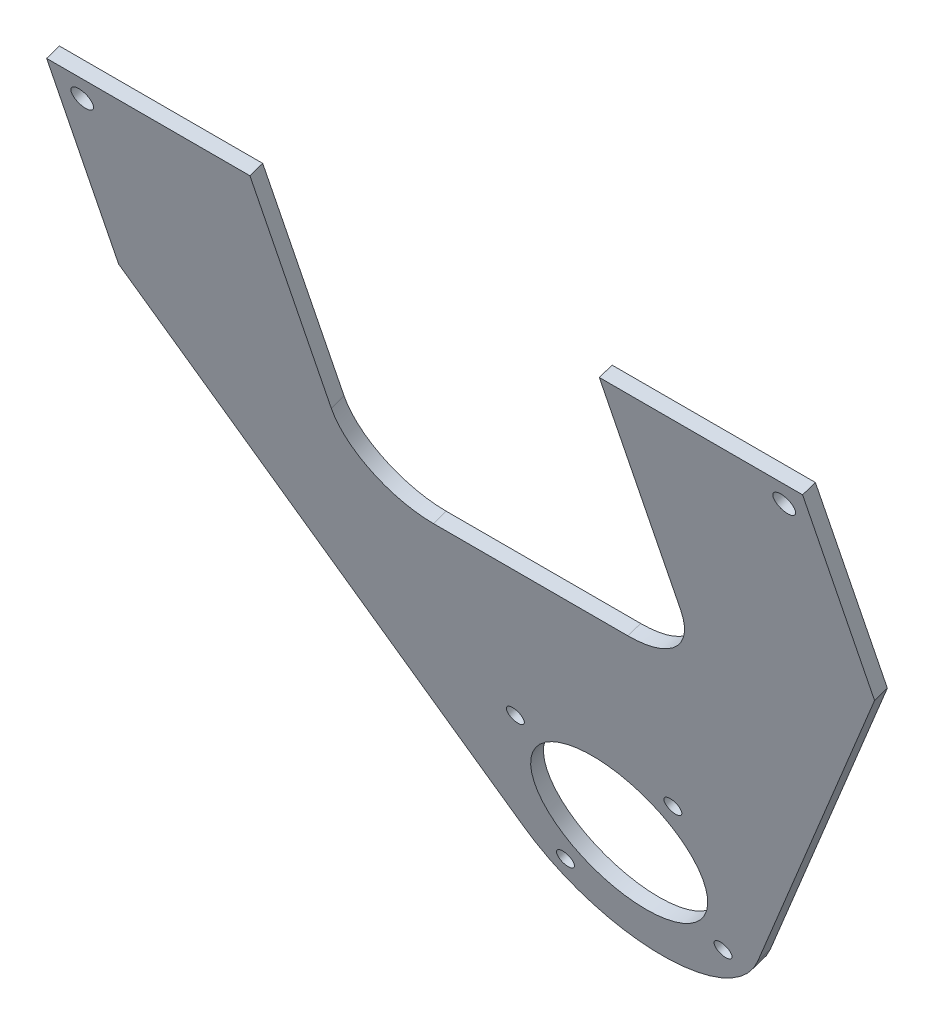
ISO-10303-21;
HEADER;
FILE_DESCRIPTION(('STEP AP214'),'2;1');
FILE_NAME('part.step','',(''),(''),'','','');
FILE_SCHEMA(('AUTOMOTIVE_DESIGN { 1 0 10303 214 1 1 1 1 }'));
ENDSEC;
DATA;
#1=APPLICATION_CONTEXT('core data for automotive mechanical design processes');
#2=APPLICATION_PROTOCOL_DEFINITION('international standard','automotive_design',2000,#1);
#3=PRODUCT_CONTEXT('',#1,'mechanical');
#4=PRODUCT('Part','Part','',(#3));
#5=PRODUCT_RELATED_PRODUCT_CATEGORY('part','',(#4));
#6=PRODUCT_DEFINITION_FORMATION('','',#4);
#7=PRODUCT_DEFINITION_CONTEXT('part definition',#1,'design');
#8=PRODUCT_DEFINITION('design','',#6,#7);
#9=PRODUCT_DEFINITION_SHAPE('','',#8);
#10=(LENGTH_UNIT() NAMED_UNIT(*) SI_UNIT(.MILLI.,.METRE.));
#11=(NAMED_UNIT(*) PLANE_ANGLE_UNIT() SI_UNIT($,.RADIAN.));
#12=(NAMED_UNIT(*) SI_UNIT($,.STERADIAN.) SOLID_ANGLE_UNIT());
#13=UNCERTAINTY_MEASURE_WITH_UNIT(LENGTH_MEASURE(1.E-05),#10,'distance_accuracy_value','');
#14=(GEOMETRIC_REPRESENTATION_CONTEXT(3) GLOBAL_UNCERTAINTY_ASSIGNED_CONTEXT((#13)) GLOBAL_UNIT_ASSIGNED_CONTEXT((#10,
#11,#12)) REPRESENTATION_CONTEXT('',''));
#15=CARTESIAN_POINT('',(0.,0.,0.));
#16=DIRECTION('',(0.,0.,1.));
#17=DIRECTION('',(1.,0.,0.));
#18=AXIS2_PLACEMENT_3D('',#15,#16,#17);
#19=CARTESIAN_POINT('',(88.9,645.377842266813,1331.10155961567));
#20=DIRECTION('',(0.,-0.947879387941359,-0.318629355075634));
#21=DIRECTION('',(0.,0.318629355075634,-0.947879387941359));
#22=AXIS2_PLACEMENT_3D('',#19,#20,#21);
#23=PLANE('',#22);
#24=DIRECTION('',(-1.,0.,0.));
#25=VECTOR('',#24,1.);
#26=CARTESIAN_POINT('',(88.9,645.377842266813,1331.10155961567));
#27=LINE('',#26,#25);
#28=CARTESIAN_POINT('',(-41.0904571991053,645.377842266813,1331.10155961567));
#29=VERTEX_POINT('',#28);
#30=CARTESIAN_POINT('',(-88.9,645.377842266813,1331.10155961567));
#31=VERTEX_POINT('',#30);
#32=EDGE_CURVE('E95',#29,#31,#27,.T.);
#33=ORIENTED_EDGE('',*,*,#32,.F.);
#34=DIRECTION('',(0.,0.318629355075634,-0.947879387941359));
#35=VECTOR('',#34,1.);
#36=CARTESIAN_POINT('',(-41.0904571991053,645.377842266813,1331.10155961567));
#37=LINE('',#36,#35);
#38=CARTESIAN_POINT('',(-41.0904571991053,646.389490469178,1328.09204255895));
#39=VERTEX_POINT('',#38);
#40=EDGE_CURVE('E11',#29,#39,#37,.T.);
#41=ORIENTED_EDGE('',*,*,#40,.T.);
#42=DIRECTION('',(-1.,0.,0.));
#43=VECTOR('',#42,1.);
#44=CARTESIAN_POINT('',(88.9,646.389490469178,1328.09204255895));
#45=LINE('',#44,#43);
#46=CARTESIAN_POINT('',(-88.9,646.389490469178,1328.09204255895));
#47=VERTEX_POINT('',#46);
#48=EDGE_CURVE('E138',#39,#47,#45,.T.);
#49=ORIENTED_EDGE('',*,*,#48,.T.);
#50=DIRECTION('',(0.,0.318629355075634,-0.947879387941359));
#51=VECTOR('',#50,1.);
#52=CARTESIAN_POINT('',(-88.9,645.377842266813,1331.10155961567));
#53=LINE('',#52,#51);
#54=EDGE_CURVE('E152',#31,#47,#53,.T.);
#55=ORIENTED_EDGE('',*,*,#54,.F.);
#56=EDGE_LOOP('',(#33,#41,#49,#55));
#57=FACE_BOUND('',#56,.T.);
#58=ADVANCED_FACE('F36',(#57),#23,.F.);
#59=CARTESIAN_POINT('',(0.,509.247687902836,1285.34145148045));
#60=DIRECTION('',(0.,-0.318629355075634,0.947879387941359));
#61=DIRECTION('',(0.,-0.947879387941359,-0.318629355075634));
#62=AXIS2_PLACEMENT_3D('',#59,#60,#61);
#63=PLANE('',#62);
#64=DIRECTION('',(1.29819621038571E-10,-0.947879387941359,-0.318629355075634));
#65=VECTOR('',#64,1.);
#66=CARTESIAN_POINT('',(-41.0904571804612,509.247687897779,1285.34145147875));
#67=LINE('',#66,#65);
#68=CARTESIAN_POINT('',(-41.0904571913077,588.44378476616,1311.96319427715));
#69=VERTEX_POINT('',#68);
#70=EDGE_CURVE('E218',#29,#69,#67,.T.);
#71=ORIENTED_EDGE('',*,*,#70,.F.);
#72=ORIENTED_EDGE('',*,*,#32,.T.);
#73=DIRECTION('',(0.,-0.947879387941358,-0.318629355075636));
#74=VECTOR('',#73,1.);
#75=CARTESIAN_POINT('',(-88.9,645.377842266813,1331.10155961567));
#76=LINE('',#75,#74);
#77=CARTESIAN_POINT('',(-88.9,595.011167325718,1314.17081783781));
#78=VERTEX_POINT('',#77);
#79=EDGE_CURVE('E185',#31,#78,#76,.T.);
#80=ORIENTED_EDGE('',*,*,#79,.T.);
#81=DIRECTION('',(0.500000000000001,-0.820887629680862,-0.275941115886951));
#82=VECTOR('',#81,1.);
#83=CARTESIAN_POINT('',(-88.9,595.011167325718,1314.17081783781));
#84=LINE('',#83,#82);
#85=CARTESIAN_POINT('',(-27.4963065702007,494.200102619242,1280.28321046862));
#86=VERTEX_POINT('',#85);
#87=EDGE_CURVE('E113',#78,#86,#84,.T.);
#88=ORIENTED_EDGE('',*,*,#87,.T.);
#89=CARTESIAN_POINT('',(0.,509.247687902836,1285.34145148045));
#90=DIRECTION('',(0.,-0.318629355075634,0.947879387941359));
#91=DIRECTION('',(0.,-0.947879387941359,-0.318629355075634));
#92=AXIS2_PLACEMENT_3D('',#89,#90,#91);
#93=CIRCLE('',#92,31.7500000000519);
#94=CARTESIAN_POINT('',(27.4963065702007,494.200102619242,1280.28321046862));
#95=VERTEX_POINT('',#94);
#96=EDGE_CURVE('E105',#86,#95,#93,.T.);
#97=ORIENTED_EDGE('',*,*,#96,.T.);
#98=DIRECTION('',(0.500000000000045,0.820887629680837,0.275941115886943));
#99=VECTOR('',#98,1.);
#100=CARTESIAN_POINT('',(27.4963065702007,494.200102619242,1280.28321046862));
#101=LINE('',#100,#99);
#102=CARTESIAN_POINT('',(88.9,595.011167325706,1314.17081783781));
#103=VERTEX_POINT('',#102);
#104=EDGE_CURVE('E110',#95,#103,#101,.T.);
#105=ORIENTED_EDGE('',*,*,#104,.T.);
#106=DIRECTION('',(0.,0.947879387941359,0.318629355075635));
#107=VECTOR('',#106,1.);
#108=CARTESIAN_POINT('',(88.9,595.011167325706,1314.17081783781));
#109=LINE('',#108,#107);
#110=CARTESIAN_POINT('',(88.9,645.377842266813,1331.10155961567));
#111=VERTEX_POINT('',#110);
#112=EDGE_CURVE('E60',#103,#111,#109,.T.);
#113=ORIENTED_EDGE('',*,*,#112,.T.);
#114=CARTESIAN_POINT('',(41.0904571951463,645.377842266813,1331.10155961567));
#115=VERTEX_POINT('',#114);
#116=EDGE_CURVE('E178',#111,#115,#27,.T.);
#117=ORIENTED_EDGE('',*,*,#116,.T.);
#118=DIRECTION('',(0.,0.947879387941359,0.318629355075634));
#119=VECTOR('',#118,1.);
#120=CARTESIAN_POINT('',(41.0904571951462,509.247687902836,1285.34145148045));
#121=LINE('',#120,#119);
#122=CARTESIAN_POINT('',(41.0904571951463,588.44378476616,1311.96319427715));
#123=VERTEX_POINT('',#122);
#124=EDGE_CURVE('E51',#123,#115,#121,.T.);
#125=ORIENTED_EDGE('',*,*,#124,.F.);
#126=CARTESIAN_POINT('',(22.8600000279249,588.44378476616,1311.96319427715));
#127=DIRECTION('',(0.,-0.318629355075634,0.947879387941359));
#128=DIRECTION('',(0.,-0.947879387941359,-0.318629355075634));
#129=AXIS2_PLACEMENT_3D('',#126,#127,#128);
#130=CIRCLE('',#129,18.2304571672214);
#131=CARTESIAN_POINT('',(22.860000027925,571.163510184603,1306.15443546722));
#132=VERTEX_POINT('',#131);
#133=EDGE_CURVE('E215',#132,#123,#130,.T.);
#134=ORIENTED_EDGE('',*,*,#133,.F.);
#135=DIRECTION('',(1.,0.,0.));
#136=VECTOR('',#135,1.);
#137=CARTESIAN_POINT('',(0.,571.163510184603,1306.15443546722));
#138=LINE('',#137,#136);
#139=CARTESIAN_POINT('',(-22.8600000217195,571.163510184603,1306.15443546722));
#140=VERTEX_POINT('',#139);
#141=EDGE_CURVE('E212',#140,#132,#138,.T.);
#142=ORIENTED_EDGE('',*,*,#141,.F.);
#143=CARTESIAN_POINT('',(-22.8600000217195,588.443784768403,1311.9631942779));
#144=DIRECTION('',(0.,-0.318629355075634,0.947879387941359));
#145=DIRECTION('',(0.,-0.947879387941359,-0.318629355075634));
#146=AXIS2_PLACEMENT_3D('',#143,#144,#145);
#147=CIRCLE('',#146,18.2304571695882);
#148=EDGE_CURVE('E209',#69,#140,#147,.T.);
#149=ORIENTED_EDGE('',*,*,#148,.F.);
#150=EDGE_LOOP('',(#71,#72,#80,#88,#97,#105,#113,#117,#125,#134,#142,#149));
#151=FACE_BOUND('',#150,.T.);
#152=CARTESIAN_POINT('',(18.5217782496758,491.691276071892,1279.43986922188));
#153=DIRECTION('',(0.,-0.318629355075631,0.94787938794136));
#154=DIRECTION('',(0.,-0.94787938794136,-0.318629355075631));
#155=AXIS2_PLACEMENT_3D('',#152,#153,#154);
#156=CIRCLE('',#155,2.01929999999999);
#157=CARTESIAN_POINT('',(18.5217782496758,489.777223223822,1278.79646096518));
#158=VERTEX_POINT('',#157);
#159=EDGE_CURVE('E175',#158,#158,#156,.T.);
#160=ORIENTED_EDGE('',*,*,#159,.F.);
#161=EDGE_LOOP('',(#160));
#162=FACE_BOUND('',#161,.T.);
#163=CARTESIAN_POINT('',(-18.5217782497932,491.691276071892,1279.43986922188));
#164=DIRECTION('',(0.,-0.318629355075631,0.94787938794136));
#165=DIRECTION('',(0.,-0.94787938794136,-0.318629355075631));
#166=AXIS2_PLACEMENT_3D('',#163,#164,#165);
#167=CIRCLE('',#166,2.01929999999999);
#168=CARTESIAN_POINT('',(-18.5217782497932,489.777223223822,1278.79646096518));
#169=VERTEX_POINT('',#168);
#170=EDGE_CURVE('E172',#169,#169,#167,.T.);
#171=ORIENTED_EDGE('',*,*,#170,.F.);
#172=EDGE_LOOP('',(#171));
#173=FACE_BOUND('',#172,.T.);
#174=CARTESIAN_POINT('',(-18.5217782497932,526.80409973378,1291.24303373901));
#175=DIRECTION('',(0.,-0.318629355075631,0.94787938794136));
#176=DIRECTION('',(0.,-0.94787938794136,-0.318629355075631));
#177=AXIS2_PLACEMENT_3D('',#174,#175,#176);
#178=CIRCLE('',#177,2.01929999999999);
#179=CARTESIAN_POINT('',(-18.5217782497932,524.89004688571,1290.59962548231));
#180=VERTEX_POINT('',#179);
#181=EDGE_CURVE('E168',#180,#180,#178,.T.);
#182=ORIENTED_EDGE('',*,*,#181,.F.);
#183=EDGE_LOOP('',(#182));
#184=FACE_BOUND('',#183,.T.);
#185=CARTESIAN_POINT('',(18.5217782496758,526.80409973378,1291.24303373901));
#186=DIRECTION('',(0.,-0.318629355075631,0.94787938794136));
#187=DIRECTION('',(0.,-0.94787938794136,-0.318629355075631));
#188=AXIS2_PLACEMENT_3D('',#185,#186,#187);
#189=CIRCLE('',#188,2.01929999999999);
#190=CARTESIAN_POINT('',(18.5217782496758,524.89004688571,1290.59962548231));
#191=VERTEX_POINT('',#190);
#192=EDGE_CURVE('E167',#191,#191,#189,.T.);
#193=ORIENTED_EDGE('',*,*,#192,.F.);
#194=EDGE_LOOP('',(#193));
#195=FACE_BOUND('',#194,.T.);
#196=CARTESIAN_POINT('',(82.55,639.358808153386,1329.07826321093));
#197=DIRECTION('',(0.,-0.318629355075631,0.94787938794136));
#198=DIRECTION('',(0.,-0.94787938794136,-0.318629355075631));
#199=AXIS2_PLACEMENT_3D('',#196,#197,#198);
#200=CIRCLE('',#199,2.55269999999999);
#201=CARTESIAN_POINT('',(82.55,636.939156439788,1328.26489805623));
#202=VERTEX_POINT('',#201);
#203=EDGE_CURVE('E163',#202,#202,#200,.T.);
#204=ORIENTED_EDGE('',*,*,#203,.F.);
#205=EDGE_LOOP('',(#204));
#206=FACE_BOUND('',#205,.T.);
#207=CARTESIAN_POINT('',(-82.55,639.358808153385,1329.07826321093));
#208=DIRECTION('',(0.,-0.318629355075631,0.94787938794136));
#209=DIRECTION('',(0.,-0.94787938794136,-0.318629355075631));
#210=AXIS2_PLACEMENT_3D('',#207,#208,#209);
#211=CIRCLE('',#210,2.55269999999999);
#212=CARTESIAN_POINT('',(-82.55,636.939156439787,1328.26489805623));
#213=VERTEX_POINT('',#212);
#214=EDGE_CURVE('E159',#213,#213,#211,.T.);
#215=ORIENTED_EDGE('',*,*,#214,.F.);
#216=EDGE_LOOP('',(#215));
#217=FACE_BOUND('',#216,.T.);
#218=CARTESIAN_POINT('',(0.,509.247687902835,1285.34145148045));
#219=DIRECTION('',(0.,-0.318629355075634,0.947879387941359));
#220=DIRECTION('',(0.,-0.947879387941359,-0.318629355075634));
#221=AXIS2_PLACEMENT_3D('',#218,#219,#220);
#222=CIRCLE('',#221,19.84375);
#223=CARTESIAN_POINT('',(0.,490.438206298374,1279.01865021567));
#224=VERTEX_POINT('',#223);
#225=EDGE_CURVE('E191',#224,#224,#222,.T.);
#226=ORIENTED_EDGE('',*,*,#225,.F.);
#227=EDGE_LOOP('',(#226));
#228=FACE_BOUND('',#227,.T.);
#229=ADVANCED_FACE('F107',(#151,#162,#173,#184,#195,#206,#217,#228),#63,.T.);
#230=CARTESIAN_POINT('',(0.,510.259336105201,1282.33193442374));
#231=DIRECTION('',(0.,-0.318629355075634,0.947879387941359));
#232=DIRECTION('',(0.,-0.947879387941359,-0.318629355075634));
#233=AXIS2_PLACEMENT_3D('',#230,#231,#232);
#234=PLANE('',#233);
#235=CARTESIAN_POINT('',(18.5217782496758,492.702924274257,1276.43035216517));
#236=DIRECTION('',(0.,-0.318629355075634,0.947879387941359));
#237=DIRECTION('',(0.,-0.947879387941359,-0.318629355075634));
#238=AXIS2_PLACEMENT_3D('',#235,#236,#237);
#239=CIRCLE('',#238,2.01929999999999);
#240=CARTESIAN_POINT('',(18.5217782496758,490.788871426187,1275.78694390846));
#241=VERTEX_POINT('',#240);
#242=EDGE_CURVE('E173',#241,#241,#239,.T.);
#243=ORIENTED_EDGE('',*,*,#242,.T.);
#244=EDGE_LOOP('',(#243));
#245=FACE_BOUND('',#244,.T.);
#246=CARTESIAN_POINT('',(-18.5217782497932,492.702924274257,1276.43035216517));
#247=DIRECTION('',(0.,-0.318629355075634,0.947879387941359));
#248=DIRECTION('',(0.,-0.947879387941359,-0.318629355075634));
#249=AXIS2_PLACEMENT_3D('',#246,#247,#248);
#250=CIRCLE('',#249,2.01929999999999);
#251=CARTESIAN_POINT('',(-18.5217782497932,490.788871426187,1275.78694390846));
#252=VERTEX_POINT('',#251);
#253=EDGE_CURVE('E169',#252,#252,#250,.T.);
#254=ORIENTED_EDGE('',*,*,#253,.T.);
#255=EDGE_LOOP('',(#254));
#256=FACE_BOUND('',#255,.T.);
#257=CARTESIAN_POINT('',(-18.5217782497932,527.815747936144,1288.2335166823));
#258=DIRECTION('',(0.,-0.318629355075634,0.947879387941359));
#259=DIRECTION('',(0.,-0.947879387941359,-0.318629355075634));
#260=AXIS2_PLACEMENT_3D('',#257,#258,#259);
#261=CIRCLE('',#260,2.01929999999999);
#262=CARTESIAN_POINT('',(-18.5217782497932,525.901695088074,1287.5901084256));
#263=VERTEX_POINT('',#262);
#264=EDGE_CURVE('E164',#263,#263,#261,.T.);
#265=ORIENTED_EDGE('',*,*,#264,.T.);
#266=EDGE_LOOP('',(#265));
#267=FACE_BOUND('',#266,.T.);
#268=CARTESIAN_POINT('',(18.5217782496758,527.815747936144,1288.2335166823));
#269=DIRECTION('',(0.,-0.318629355075634,0.947879387941359));
#270=DIRECTION('',(0.,-0.947879387941359,-0.318629355075634));
#271=AXIS2_PLACEMENT_3D('',#268,#269,#270);
#272=CIRCLE('',#271,2.01929999999999);
#273=CARTESIAN_POINT('',(18.5217782496758,525.901695088074,1287.5901084256));
#274=VERTEX_POINT('',#273);
#275=EDGE_CURVE('E198',#274,#274,#272,.T.);
#276=ORIENTED_EDGE('',*,*,#275,.T.);
#277=EDGE_LOOP('',(#276));
#278=FACE_BOUND('',#277,.T.);
#279=CARTESIAN_POINT('',(82.55,640.37045635575,1326.06874615422));
#280=DIRECTION('',(0.,-0.318629355075634,0.947879387941359));
#281=DIRECTION('',(0.,-0.947879387941359,-0.318629355075634));
#282=AXIS2_PLACEMENT_3D('',#279,#280,#281);
#283=CIRCLE('',#282,2.55269999999999);
#284=CARTESIAN_POINT('',(82.55,637.950804642152,1325.25538099952));
#285=VERTEX_POINT('',#284);
#286=EDGE_CURVE('E160',#285,#285,#283,.T.);
#287=ORIENTED_EDGE('',*,*,#286,.T.);
#288=EDGE_LOOP('',(#287));
#289=FACE_BOUND('',#288,.T.);
#290=CARTESIAN_POINT('',(-82.55,640.37045635575,1326.06874615422));
#291=DIRECTION('',(0.,-0.318629355075634,0.947879387941359));
#292=DIRECTION('',(0.,-0.947879387941359,-0.318629355075634));
#293=AXIS2_PLACEMENT_3D('',#290,#291,#292);
#294=CIRCLE('',#293,2.55269999999999);
#295=CARTESIAN_POINT('',(-82.55,637.950804642152,1325.25538099952));
#296=VERTEX_POINT('',#295);
#297=EDGE_CURVE('E155',#296,#296,#294,.T.);
#298=ORIENTED_EDGE('',*,*,#297,.T.);
#299=EDGE_LOOP('',(#298));
#300=FACE_BOUND('',#299,.T.);
#301=ORIENTED_EDGE('',*,*,#48,.F.);
#302=DIRECTION('',(-1.29819621038571E-10,0.947879387941361,0.318629355075629));
#303=VECTOR('',#302,1.);
#304=CARTESIAN_POINT('',(-41.090457200482,656.441635974956,1331.47106807673));
#305=LINE('',#304,#303);
#306=CARTESIAN_POINT('',(-41.0904571913077,589.455432968526,1308.95367722043));
#307=VERTEX_POINT('',#306);
#308=EDGE_CURVE('E227',#307,#39,#305,.T.);
#309=ORIENTED_EDGE('',*,*,#308,.F.);
#310=CARTESIAN_POINT('',(-22.8600000217195,589.455432970769,1308.95367722119));
#311=DIRECTION('',(0.,0.318629355075631,-0.94787938794136));
#312=DIRECTION('',(0.,-0.94787938794136,-0.318629355075631));
#313=AXIS2_PLACEMENT_3D('',#310,#311,#312);
#314=CIRCLE('',#313,18.2304571695882);
#315=CARTESIAN_POINT('',(-22.8600000217195,572.175158386969,1303.14491841051));
#316=VERTEX_POINT('',#315);
#317=EDGE_CURVE('E237',#316,#307,#314,.T.);
#318=ORIENTED_EDGE('',*,*,#317,.F.);
#319=DIRECTION('',(-1.,0.,0.));
#320=VECTOR('',#319,1.);
#321=CARTESIAN_POINT('',(-22.8600000217198,572.175158386969,1303.14491841051));
#322=LINE('',#321,#320);
#323=CARTESIAN_POINT('',(22.860000027925,572.175158386969,1303.14491841051));
#324=VERTEX_POINT('',#323);
#325=EDGE_CURVE('E240',#324,#316,#322,.T.);
#326=ORIENTED_EDGE('',*,*,#325,.F.);
#327=CARTESIAN_POINT('',(22.8600000279249,589.455432968526,1308.95367722043));
#328=DIRECTION('',(0.,0.318629355075631,-0.94787938794136));
#329=DIRECTION('',(0.,0.94787938794136,0.318629355075631));
#330=AXIS2_PLACEMENT_3D('',#327,#328,#329);
#331=CIRCLE('',#330,18.2304571672214);
#332=CARTESIAN_POINT('',(41.0904571951463,589.455432968526,1308.95367722043));
#333=VERTEX_POINT('',#332);
#334=EDGE_CURVE('E243',#333,#324,#331,.T.);
#335=ORIENTED_EDGE('',*,*,#334,.F.);
#336=DIRECTION('',(0.,-0.94787938794136,-0.318629355075632));
#337=VECTOR('',#336,1.);
#338=CARTESIAN_POINT('',(41.0904571951463,589.455432968526,1308.95367722043));
#339=LINE('',#338,#337);
#340=CARTESIAN_POINT('',(41.0904571951463,646.389490469178,1328.09204255895));
#341=VERTEX_POINT('',#340);
#342=EDGE_CURVE('E246',#341,#333,#339,.T.);
#343=ORIENTED_EDGE('',*,*,#342,.F.);
#344=CARTESIAN_POINT('',(88.9,646.389490469178,1328.09204255895));
#345=VERTEX_POINT('',#344);
#346=EDGE_CURVE('E134',#345,#341,#45,.T.);
#347=ORIENTED_EDGE('',*,*,#346,.F.);
#348=DIRECTION('',(0.,0.947879387941359,0.318629355075635));
#349=VECTOR('',#348,1.);
#350=CARTESIAN_POINT('',(88.9,596.022815528071,1311.1613007811));
#351=LINE('',#350,#349);
#352=CARTESIAN_POINT('',(88.9,596.022815528071,1311.1613007811));
#353=VERTEX_POINT('',#352);
#354=EDGE_CURVE('E87',#353,#345,#351,.T.);
#355=ORIENTED_EDGE('',*,*,#354,.F.);
#356=DIRECTION('',(0.500000000000045,0.820887629680837,0.275941115886943));
#357=VECTOR('',#356,1.);
#358=CARTESIAN_POINT('',(27.4963065702007,495.211750821607,1277.2736934119));
#359=LINE('',#358,#357);
#360=CARTESIAN_POINT('',(27.4963065702007,495.211750821607,1277.2736934119));
#361=VERTEX_POINT('',#360);
#362=EDGE_CURVE('E143',#361,#353,#359,.T.);
#363=ORIENTED_EDGE('',*,*,#362,.F.);
#364=CARTESIAN_POINT('',(0.,510.259336105201,1282.33193442374));
#365=DIRECTION('',(0.,-0.318629355075634,0.947879387941359));
#366=DIRECTION('',(0.,-0.947879387941359,-0.318629355075634));
#367=AXIS2_PLACEMENT_3D('',#364,#365,#366);
#368=CIRCLE('',#367,31.7500000000519);
#369=CARTESIAN_POINT('',(-27.4963065702007,495.211750821607,1277.2736934119));
#370=VERTEX_POINT('',#369);
#371=EDGE_CURVE('E122',#370,#361,#368,.T.);
#372=ORIENTED_EDGE('',*,*,#371,.F.);
#373=DIRECTION('',(0.500000000000001,-0.820887629680862,-0.275941115886951));
#374=VECTOR('',#373,1.);
#375=CARTESIAN_POINT('',(-88.9,596.022815528083,1311.1613007811));
#376=LINE('',#375,#374);
#377=CARTESIAN_POINT('',(-88.9,596.022815528083,1311.1613007811));
#378=VERTEX_POINT('',#377);
#379=EDGE_CURVE('E140',#378,#370,#376,.T.);
#380=ORIENTED_EDGE('',*,*,#379,.F.);
#381=DIRECTION('',(0.,-0.947879387941358,-0.318629355075636));
#382=VECTOR('',#381,1.);
#383=CARTESIAN_POINT('',(-88.9,646.389490469178,1328.09204255895));
#384=LINE('',#383,#382);
#385=EDGE_CURVE('E137',#47,#378,#384,.T.);
#386=ORIENTED_EDGE('',*,*,#385,.F.);
#387=EDGE_LOOP('',(#301,#309,#318,#326,#335,#343,#347,#355,#363,#372,#380,#386));
#388=FACE_BOUND('',#387,.T.);
#389=CARTESIAN_POINT('',(0.,510.2593361052,1282.33193442374));
#390=DIRECTION('',(0.,-0.318629355075634,0.947879387941359));
#391=DIRECTION('',(0.,-0.947879387941359,-0.318629355075634));
#392=AXIS2_PLACEMENT_3D('',#389,#390,#391);
#393=CIRCLE('',#392,19.84375);
#394=CARTESIAN_POINT('',(0.,491.449854500739,1276.00913315895));
#395=VERTEX_POINT('',#394);
#396=EDGE_CURVE('E158',#395,#395,#393,.T.);
#397=ORIENTED_EDGE('',*,*,#396,.T.);
#398=EDGE_LOOP('',(#397));
#399=FACE_BOUND('',#398,.T.);
#400=ADVANCED_FACE('F255',(#245,#256,#267,#278,#289,#300,#388,#399),#234,.F.);
#401=ORIENTED_EDGE('',*,*,#346,.T.);
#402=DIRECTION('',(0.,-0.318629355075634,0.947879387941359));
#403=VECTOR('',#402,1.);
#404=CARTESIAN_POINT('',(41.0904571951463,645.377842266813,1331.10155961567));
#405=LINE('',#404,#403);
#406=EDGE_CURVE('E44',#341,#115,#405,.T.);
#407=ORIENTED_EDGE('',*,*,#406,.T.);
#408=ORIENTED_EDGE('',*,*,#116,.F.);
#409=DIRECTION('',(0.,0.318629355075634,-0.947879387941359));
#410=VECTOR('',#409,1.);
#411=CARTESIAN_POINT('',(88.9,645.377842266813,1331.10155961567));
#412=LINE('',#411,#410);
#413=EDGE_CURVE('E130',#111,#345,#412,.T.);
#414=ORIENTED_EDGE('',*,*,#413,.T.);
#415=EDGE_LOOP('',(#401,#407,#408,#414));
#416=FACE_BOUND('',#415,.T.);
#417=ADVANCED_FACE('F38',(#416),#23,.F.);
#418=CARTESIAN_POINT('',(-88.9,645.377842266813,1331.10155961567));
#419=DIRECTION('',(1.,0.,0.));
#420=DIRECTION('',(0.,0.,-1.));
#421=AXIS2_PLACEMENT_3D('',#418,#419,#420);
#422=PLANE('',#421);
#423=ORIENTED_EDGE('',*,*,#385,.T.);
#424=DIRECTION('',(0.,0.318629355075634,-0.947879387941359));
#425=VECTOR('',#424,1.);
#426=CARTESIAN_POINT('',(-88.9,595.011167325718,1314.17081783781));
#427=LINE('',#426,#425);
#428=EDGE_CURVE('E149',#78,#378,#427,.T.);
#429=ORIENTED_EDGE('',*,*,#428,.F.);
#430=ORIENTED_EDGE('',*,*,#79,.F.);
#431=ORIENTED_EDGE('',*,*,#54,.T.);
#432=EDGE_LOOP('',(#423,#429,#430,#431));
#433=FACE_BOUND('',#432,.T.);
#434=ADVANCED_FACE('F291',(#433),#422,.F.);
#435=CARTESIAN_POINT('',(-88.9,595.011167325718,1314.17081783781));
#436=DIRECTION('',(0.866025403784438,0.47393969397068,0.159314677537817));
#437=DIRECTION('',(-0.480071234399904,0.877229508111618,0.));
#438=AXIS2_PLACEMENT_3D('',#435,#436,#437);
#439=PLANE('',#438);
#440=ORIENTED_EDGE('',*,*,#379,.T.);
#441=DIRECTION('',(0.,0.318629355075634,-0.947879387941359));
#442=VECTOR('',#441,1.);
#443=CARTESIAN_POINT('',(-27.4963065702007,494.200102619242,1280.28321046862));
#444=LINE('',#443,#442);
#445=EDGE_CURVE('E125',#86,#370,#444,.T.);
#446=ORIENTED_EDGE('',*,*,#445,.F.);
#447=ORIENTED_EDGE('',*,*,#87,.F.);
#448=ORIENTED_EDGE('',*,*,#428,.T.);
#449=EDGE_LOOP('',(#440,#446,#447,#448));
#450=FACE_BOUND('',#449,.T.);
#451=ADVANCED_FACE('F295',(#450),#439,.F.);
#452=CARTESIAN_POINT('',(0.,509.247687902836,1285.34145148045));
#453=DIRECTION('',(0.,0.318629355075634,-0.947879387941359));
#454=DIRECTION('',(0.,0.947879387941359,0.318629355075634));
#455=AXIS2_PLACEMENT_3D('',#452,#453,#454);
#456=CYLINDRICAL_SURFACE('',#455,31.7500000000519);
#457=ORIENTED_EDGE('',*,*,#371,.T.);
#458=DIRECTION('',(0.,0.318629355075634,-0.947879387941359));
#459=VECTOR('',#458,1.);
#460=CARTESIAN_POINT('',(27.4963065702007,494.200102619242,1280.28321046862));
#461=LINE('',#460,#459);
#462=EDGE_CURVE('E119',#95,#361,#461,.T.);
#463=ORIENTED_EDGE('',*,*,#462,.F.);
#464=ORIENTED_EDGE('',*,*,#96,.F.);
#465=ORIENTED_EDGE('',*,*,#445,.T.);
#466=EDGE_LOOP('',(#457,#463,#464,#465));
#467=FACE_BOUND('',#466,.T.);
#468=ADVANCED_FACE('F120',(#467),#456,.T.);
#469=CARTESIAN_POINT('',(27.4963065702007,494.200102619242,1280.28321046862));
#470=DIRECTION('',(-0.866025403784413,0.473939693970722,0.159314677537831));
#471=DIRECTION('',(-0.480071234399948,-0.877229508111595,0.));
#472=AXIS2_PLACEMENT_3D('',#469,#470,#471);
#473=PLANE('',#472);
#474=ORIENTED_EDGE('',*,*,#362,.T.);
#475=DIRECTION('',(0.,0.318629355075634,-0.947879387941359));
#476=VECTOR('',#475,1.);
#477=CARTESIAN_POINT('',(88.9,595.011167325706,1314.17081783781));
#478=LINE('',#477,#476);
#479=EDGE_CURVE('E126',#103,#353,#478,.T.);
#480=ORIENTED_EDGE('',*,*,#479,.F.);
#481=ORIENTED_EDGE('',*,*,#104,.F.);
#482=ORIENTED_EDGE('',*,*,#462,.T.);
#483=EDGE_LOOP('',(#474,#480,#481,#482));
#484=FACE_BOUND('',#483,.T.);
#485=ADVANCED_FACE('F128',(#484),#473,.F.);
#486=CARTESIAN_POINT('',(88.9,595.011167325706,1314.17081783781));
#487=DIRECTION('',(-1.,0.,0.));
#488=DIRECTION('',(0.,0.,1.));
#489=AXIS2_PLACEMENT_3D('',#486,#487,#488);
#490=PLANE('',#489);
#491=ORIENTED_EDGE('',*,*,#354,.T.);
#492=ORIENTED_EDGE('',*,*,#413,.F.);
#493=ORIENTED_EDGE('',*,*,#112,.F.);
#494=ORIENTED_EDGE('',*,*,#479,.T.);
#495=EDGE_LOOP('',(#491,#492,#493,#494));
#496=FACE_BOUND('',#495,.T.);
#497=ADVANCED_FACE('F296',(#496),#490,.F.);
#498=CARTESIAN_POINT('',(0.,509.247687902835,1285.34145148045));
#499=DIRECTION('',(0.,0.318629355075634,-0.947879387941359));
#500=DIRECTION('',(0.,0.947879387941359,0.318629355075634));
#501=AXIS2_PLACEMENT_3D('',#498,#499,#500);
#502=CYLINDRICAL_SURFACE('',#501,19.84375);
#503=ORIENTED_EDGE('',*,*,#225,.T.);
#504=EDGE_LOOP('',(#503));
#505=FACE_BOUND('',#504,.T.);
#506=ORIENTED_EDGE('',*,*,#396,.F.);
#507=EDGE_LOOP('',(#506));
#508=FACE_BOUND('',#507,.T.);
#509=ADVANCED_FACE('F298',(#505,#508),#502,.F.);
#510=CARTESIAN_POINT('',(-82.55,639.358808153385,1329.07826321093));
#511=DIRECTION('',(0.,-0.318629355075631,0.94787938794136));
#512=DIRECTION('',(0.,-0.94787938794136,-0.318629355075631));
#513=AXIS2_PLACEMENT_3D('',#510,#511,#512);
#514=CYLINDRICAL_SURFACE('',#513,2.55269999999999);
#515=ORIENTED_EDGE('',*,*,#214,.T.);
#516=EDGE_LOOP('',(#515));
#517=FACE_BOUND('',#516,.T.);
#518=ORIENTED_EDGE('',*,*,#297,.F.);
#519=EDGE_LOOP('',(#518));
#520=FACE_BOUND('',#519,.T.);
#521=ADVANCED_FACE('F304',(#517,#520),#514,.F.);
#522=CARTESIAN_POINT('',(82.55,639.358808153386,1329.07826321093));
#523=DIRECTION('',(0.,-0.318629355075631,0.94787938794136));
#524=DIRECTION('',(0.,-0.94787938794136,-0.318629355075631));
#525=AXIS2_PLACEMENT_3D('',#522,#523,#524);
#526=CYLINDRICAL_SURFACE('',#525,2.55269999999999);
#527=ORIENTED_EDGE('',*,*,#203,.T.);
#528=EDGE_LOOP('',(#527));
#529=FACE_BOUND('',#528,.T.);
#530=ORIENTED_EDGE('',*,*,#286,.F.);
#531=EDGE_LOOP('',(#530));
#532=FACE_BOUND('',#531,.T.);
#533=ADVANCED_FACE('F326',(#529,#532),#526,.F.);
#534=CARTESIAN_POINT('',(18.5217782496758,526.80409973378,1291.24303373901));
#535=DIRECTION('',(0.,-0.318629355075631,0.94787938794136));
#536=DIRECTION('',(0.,-0.94787938794136,-0.318629355075631));
#537=AXIS2_PLACEMENT_3D('',#534,#535,#536);
#538=CYLINDRICAL_SURFACE('',#537,2.01929999999999);
#539=ORIENTED_EDGE('',*,*,#192,.T.);
#540=EDGE_LOOP('',(#539));
#541=FACE_BOUND('',#540,.T.);
#542=ORIENTED_EDGE('',*,*,#275,.F.);
#543=EDGE_LOOP('',(#542));
#544=FACE_BOUND('',#543,.T.);
#545=ADVANCED_FACE('F330',(#541,#544),#538,.F.);
#546=CARTESIAN_POINT('',(-18.5217782497932,526.80409973378,1291.24303373901));
#547=DIRECTION('',(0.,-0.318629355075631,0.94787938794136));
#548=DIRECTION('',(0.,-0.94787938794136,-0.318629355075631));
#549=AXIS2_PLACEMENT_3D('',#546,#547,#548);
#550=CYLINDRICAL_SURFACE('',#549,2.01929999999999);
#551=ORIENTED_EDGE('',*,*,#181,.T.);
#552=EDGE_LOOP('',(#551));
#553=FACE_BOUND('',#552,.T.);
#554=ORIENTED_EDGE('',*,*,#264,.F.);
#555=EDGE_LOOP('',(#554));
#556=FACE_BOUND('',#555,.T.);
#557=ADVANCED_FACE('F334',(#553,#556),#550,.F.);
#558=CARTESIAN_POINT('',(-18.5217782497932,491.691276071892,1279.43986922188));
#559=DIRECTION('',(0.,-0.318629355075631,0.94787938794136));
#560=DIRECTION('',(0.,-0.94787938794136,-0.318629355075631));
#561=AXIS2_PLACEMENT_3D('',#558,#559,#560);
#562=CYLINDRICAL_SURFACE('',#561,2.01929999999999);
#563=ORIENTED_EDGE('',*,*,#170,.T.);
#564=EDGE_LOOP('',(#563));
#565=FACE_BOUND('',#564,.T.);
#566=ORIENTED_EDGE('',*,*,#253,.F.);
#567=EDGE_LOOP('',(#566));
#568=FACE_BOUND('',#567,.T.);
#569=ADVANCED_FACE('F338',(#565,#568),#562,.F.);
#570=CARTESIAN_POINT('',(18.5217782496758,491.691276071892,1279.43986922188));
#571=DIRECTION('',(0.,-0.318629355075631,0.94787938794136));
#572=DIRECTION('',(0.,-0.94787938794136,-0.318629355075631));
#573=AXIS2_PLACEMENT_3D('',#570,#571,#572);
#574=CYLINDRICAL_SURFACE('',#573,2.01929999999999);
#575=ORIENTED_EDGE('',*,*,#159,.T.);
#576=EDGE_LOOP('',(#575));
#577=FACE_BOUND('',#576,.T.);
#578=ORIENTED_EDGE('',*,*,#242,.F.);
#579=EDGE_LOOP('',(#578));
#580=FACE_BOUND('',#579,.T.);
#581=ADVANCED_FACE('F342',(#577,#580),#574,.F.);
#582=CARTESIAN_POINT('',(-41.090457200482,638.55401719219,1384.68432314393));
#583=DIRECTION('',(-1.,-1.2305334293282E-10,-4.13643421276829E-11));
#584=DIRECTION('',(1.2305334293282E-10,-1.,0.));
#585=AXIS2_PLACEMENT_3D('',#582,#583,#584);
#586=PLANE('',#585);
#587=ORIENTED_EDGE('',*,*,#70,.T.);
#588=DIRECTION('',(0.,0.318629355075631,-0.94787938794136));
#589=VECTOR('',#588,1.);
#590=CARTESIAN_POINT('',(-41.0904571913077,571.567814185759,1362.16693228763));
#591=LINE('',#590,#589);
#592=EDGE_CURVE('E222',#69,#307,#591,.T.);
#593=ORIENTED_EDGE('',*,*,#592,.T.);
#594=ORIENTED_EDGE('',*,*,#308,.T.);
#595=ORIENTED_EDGE('',*,*,#40,.F.);
#596=EDGE_LOOP('',(#587,#593,#594,#595));
#597=FACE_BOUND('',#596,.T.);
#598=ADVANCED_FACE('F287',(#597),#586,.F.);
#599=CARTESIAN_POINT('',(-22.8600000217195,571.567814188003,1362.16693228839));
#600=DIRECTION('',(0.,0.318629355075631,-0.94787938794136));
#601=DIRECTION('',(0.,0.94787938794136,0.318629355075631));
#602=AXIS2_PLACEMENT_3D('',#599,#600,#601);
#603=CYLINDRICAL_SURFACE('',#602,18.2304571695882);
#604=ORIENTED_EDGE('',*,*,#148,.T.);
#605=DIRECTION('',(0.,0.318629355075631,-0.94787938794136));
#606=VECTOR('',#605,1.);
#607=CARTESIAN_POINT('',(-22.8600000217195,554.287539604202,1356.35817347771));
#608=LINE('',#607,#606);
#609=EDGE_CURVE('E230',#140,#316,#608,.T.);
#610=ORIENTED_EDGE('',*,*,#609,.T.);
#611=ORIENTED_EDGE('',*,*,#317,.T.);
#612=ORIENTED_EDGE('',*,*,#592,.F.);
#613=EDGE_LOOP('',(#604,#610,#611,#612));
#614=FACE_BOUND('',#613,.T.);
#615=ADVANCED_FACE('F282',(#614),#603,.F.);
#616=CARTESIAN_POINT('',(-22.8600000217198,554.287539604202,1356.35817347771));
#617=DIRECTION('',(0.,-0.94787938794136,-0.318629355075631));
#618=DIRECTION('',(0.,0.318629355075631,-0.94787938794136));
#619=AXIS2_PLACEMENT_3D('',#616,#617,#618);
#620=PLANE('',#619);
#621=ORIENTED_EDGE('',*,*,#141,.T.);
#622=DIRECTION('',(0.,0.318629355075631,-0.94787938794136));
#623=VECTOR('',#622,1.);
#624=CARTESIAN_POINT('',(22.860000027925,554.287539604202,1356.35817347771));
#625=LINE('',#624,#623);
#626=EDGE_CURVE('E226',#132,#324,#625,.T.);
#627=ORIENTED_EDGE('',*,*,#626,.T.);
#628=ORIENTED_EDGE('',*,*,#325,.T.);
#629=ORIENTED_EDGE('',*,*,#609,.F.);
#630=EDGE_LOOP('',(#621,#627,#628,#629));
#631=FACE_BOUND('',#630,.T.);
#632=ADVANCED_FACE('F283',(#631),#620,.F.);
#633=CARTESIAN_POINT('',(22.8600000279249,571.567814185759,1362.16693228763));
#634=DIRECTION('',(0.,0.318629355075631,-0.94787938794136));
#635=DIRECTION('',(0.,0.94787938794136,0.318629355075631));
#636=AXIS2_PLACEMENT_3D('',#633,#634,#635);
#637=CYLINDRICAL_SURFACE('',#636,18.2304571672214);
#638=ORIENTED_EDGE('',*,*,#133,.T.);
#639=DIRECTION('',(0.,0.318629355075631,-0.94787938794136));
#640=VECTOR('',#639,1.);
#641=CARTESIAN_POINT('',(41.0904571951463,571.567814185759,1362.16693228763));
#642=LINE('',#641,#640);
#643=EDGE_CURVE('E223',#123,#333,#642,.T.);
#644=ORIENTED_EDGE('',*,*,#643,.T.);
#645=ORIENTED_EDGE('',*,*,#334,.T.);
#646=ORIENTED_EDGE('',*,*,#626,.F.);
#647=EDGE_LOOP('',(#638,#644,#645,#646));
#648=FACE_BOUND('',#647,.T.);
#649=ADVANCED_FACE('F260',(#648),#637,.F.);
#650=CARTESIAN_POINT('',(41.0904571951463,571.567814185759,1362.16693228763));
#651=DIRECTION('',(1.,0.,0.));
#652=DIRECTION('',(0.,1.,0.));
#653=AXIS2_PLACEMENT_3D('',#650,#651,#652);
#654=PLANE('',#653);
#655=ORIENTED_EDGE('',*,*,#124,.T.);
#656=ORIENTED_EDGE('',*,*,#406,.F.);
#657=ORIENTED_EDGE('',*,*,#342,.T.);
#658=ORIENTED_EDGE('',*,*,#643,.F.);
#659=EDGE_LOOP('',(#655,#656,#657,#658));
#660=FACE_BOUND('',#659,.T.);
#661=ADVANCED_FACE('F249',(#660),#654,.F.);
#662=CLOSED_SHELL('',(#58,#229,#400,#417,#434,#451,#468,#485,#497,#509,#521,#533,#545,#557,#569,
#581,#598,#615,#632,#649,#661));
#663=MANIFOLD_SOLID_BREP('B2',#662);
#664=ADVANCED_BREP_SHAPE_REPRESENTATION('',(#18,#663),#14);
#665=SHAPE_DEFINITION_REPRESENTATION(#9,#664);
ENDSEC;
END-ISO-10303-21;
